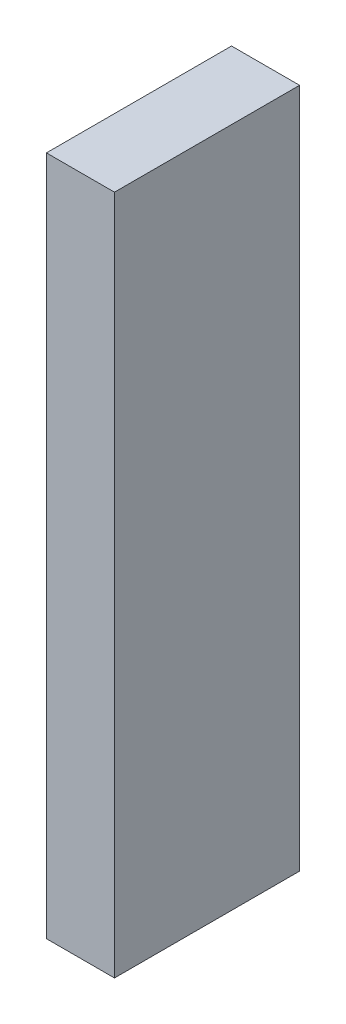
ISO-10303-21;
HEADER;
FILE_DESCRIPTION(('STEP AP214'),'2;1');
FILE_NAME('part.step','',(''),(''),'','','');
FILE_SCHEMA(('AUTOMOTIVE_DESIGN { 1 0 10303 214 1 1 1 1 }'));
ENDSEC;
DATA;
#1=APPLICATION_CONTEXT('core data for automotive mechanical design processes');
#2=APPLICATION_PROTOCOL_DEFINITION('international standard','automotive_design',2000,#1);
#3=PRODUCT_CONTEXT('',#1,'mechanical');
#4=PRODUCT('Part','Part','',(#3));
#5=PRODUCT_RELATED_PRODUCT_CATEGORY('part','',(#4));
#6=PRODUCT_DEFINITION_FORMATION('','',#4);
#7=PRODUCT_DEFINITION_CONTEXT('part definition',#1,'design');
#8=PRODUCT_DEFINITION('design','',#6,#7);
#9=PRODUCT_DEFINITION_SHAPE('','',#8);
#10=(LENGTH_UNIT() NAMED_UNIT(*) SI_UNIT(.MILLI.,.METRE.));
#11=(NAMED_UNIT(*) PLANE_ANGLE_UNIT() SI_UNIT($,.RADIAN.));
#12=(NAMED_UNIT(*) SI_UNIT($,.STERADIAN.) SOLID_ANGLE_UNIT());
#13=UNCERTAINTY_MEASURE_WITH_UNIT(LENGTH_MEASURE(1.E-05),#10,'distance_accuracy_value','');
#14=(GEOMETRIC_REPRESENTATION_CONTEXT(3) GLOBAL_UNCERTAINTY_ASSIGNED_CONTEXT((#13)) GLOBAL_UNIT_ASSIGNED_CONTEXT((#10,
#11,#12)) REPRESENTATION_CONTEXT('',''));
#15=CARTESIAN_POINT('',(0.,0.,0.));
#16=DIRECTION('',(0.,0.,1.));
#17=DIRECTION('',(1.,0.,0.));
#18=AXIS2_PLACEMENT_3D('',#15,#16,#17);
#19=CARTESIAN_POINT('',(3.175,-15.875,-4.318));
#20=DIRECTION('',(0.,0.,1.));
#21=DIRECTION('',(1.,0.,0.));
#22=AXIS2_PLACEMENT_3D('',#19,#20,#21);
#23=PLANE('',#22);
#24=DIRECTION('',(0.,1.,0.));
#25=VECTOR('',#24,1.);
#26=CARTESIAN_POINT('',(0.,-15.875,-4.318));
#27=LINE('',#26,#25);
#28=CARTESIAN_POINT('',(0.,-15.875,-4.318));
#29=VERTEX_POINT('',#28);
#30=CARTESIAN_POINT('',(0.,15.875,-4.318));
#31=VERTEX_POINT('',#30);
#32=EDGE_CURVE('E96',#29,#31,#27,.T.);
#33=ORIENTED_EDGE('',*,*,#32,.T.);
#34=DIRECTION('',(-1.,0.,0.));
#35=VECTOR('',#34,1.);
#36=CARTESIAN_POINT('',(3.175,15.875,-4.318));
#37=LINE('',#36,#35);
#38=CARTESIAN_POINT('',(3.175,15.875,-4.318));
#39=VERTEX_POINT('',#38);
#40=EDGE_CURVE('E11',#39,#31,#37,.T.);
#41=ORIENTED_EDGE('',*,*,#40,.F.);
#42=DIRECTION('',(0.,1.,0.));
#43=VECTOR('',#42,1.);
#44=CARTESIAN_POINT('',(3.175,-15.875,-4.318));
#45=LINE('',#44,#43);
#46=CARTESIAN_POINT('',(3.175,-15.875,-4.318));
#47=VERTEX_POINT('',#46);
#48=EDGE_CURVE('E84',#47,#39,#45,.T.);
#49=ORIENTED_EDGE('',*,*,#48,.F.);
#50=DIRECTION('',(-1.,0.,0.));
#51=VECTOR('',#50,1.);
#52=CARTESIAN_POINT('',(3.175,-15.875,-4.318));
#53=LINE('',#52,#51);
#54=EDGE_CURVE('E92',#47,#29,#53,.T.);
#55=ORIENTED_EDGE('',*,*,#54,.T.);
#56=EDGE_LOOP('',(#33,#41,#49,#55));
#57=FACE_BOUND('',#56,.T.);
#58=ADVANCED_FACE('F33',(#57),#23,.F.);
#59=CARTESIAN_POINT('',(3.175,15.875,4.318));
#60=DIRECTION('',(0.,-1.,0.));
#61=DIRECTION('',(0.,0.,-1.));
#62=AXIS2_PLACEMENT_3D('',#59,#60,#61);
#63=PLANE('',#62);
#64=DIRECTION('',(0.,0.,1.));
#65=VECTOR('',#64,1.);
#66=CARTESIAN_POINT('',(0.,15.875,4.318));
#67=LINE('',#66,#65);
#68=CARTESIAN_POINT('',(0.,15.875,4.318));
#69=VERTEX_POINT('',#68);
#70=EDGE_CURVE('E88',#31,#69,#67,.T.);
#71=ORIENTED_EDGE('',*,*,#70,.T.);
#72=DIRECTION('',(-1.,0.,0.));
#73=VECTOR('',#72,1.);
#74=CARTESIAN_POINT('',(3.175,15.875,4.318));
#75=LINE('',#74,#73);
#76=CARTESIAN_POINT('',(3.175,15.875,4.318));
#77=VERTEX_POINT('',#76);
#78=EDGE_CURVE('E41',#77,#69,#75,.T.);
#79=ORIENTED_EDGE('',*,*,#78,.F.);
#80=DIRECTION('',(0.,0.,1.));
#81=VECTOR('',#80,1.);
#82=CARTESIAN_POINT('',(3.175,15.875,4.318));
#83=LINE('',#82,#81);
#84=EDGE_CURVE('E79',#39,#77,#83,.T.);
#85=ORIENTED_EDGE('',*,*,#84,.F.);
#86=ORIENTED_EDGE('',*,*,#40,.T.);
#87=EDGE_LOOP('',(#71,#79,#85,#86));
#88=FACE_BOUND('',#87,.T.);
#89=ADVANCED_FACE('F87',(#88),#63,.F.);
#90=CARTESIAN_POINT('',(3.175,-15.875,4.318));
#91=DIRECTION('',(0.,0.,-1.));
#92=DIRECTION('',(-1.,0.,0.));
#93=AXIS2_PLACEMENT_3D('',#90,#91,#92);
#94=PLANE('',#93);
#95=DIRECTION('',(0.,-1.,0.));
#96=VECTOR('',#95,1.);
#97=CARTESIAN_POINT('',(0.,-15.875,4.318));
#98=LINE('',#97,#96);
#99=CARTESIAN_POINT('',(0.,-15.875,4.318));
#100=VERTEX_POINT('',#99);
#101=EDGE_CURVE('E66',#69,#100,#98,.T.);
#102=ORIENTED_EDGE('',*,*,#101,.T.);
#103=DIRECTION('',(-1.,0.,0.));
#104=VECTOR('',#103,1.);
#105=CARTESIAN_POINT('',(3.175,-15.875,4.318));
#106=LINE('',#105,#104);
#107=CARTESIAN_POINT('',(3.175,-15.875,4.318));
#108=VERTEX_POINT('',#107);
#109=EDGE_CURVE('E89',#108,#100,#106,.T.);
#110=ORIENTED_EDGE('',*,*,#109,.F.);
#111=DIRECTION('',(0.,-1.,0.));
#112=VECTOR('',#111,1.);
#113=CARTESIAN_POINT('',(3.175,-15.875,4.318));
#114=LINE('',#113,#112);
#115=EDGE_CURVE('E82',#77,#108,#114,.T.);
#116=ORIENTED_EDGE('',*,*,#115,.F.);
#117=ORIENTED_EDGE('',*,*,#78,.T.);
#118=EDGE_LOOP('',(#102,#110,#116,#117));
#119=FACE_BOUND('',#118,.T.);
#120=ADVANCED_FACE('F90',(#119),#94,.F.);
#121=CARTESIAN_POINT('',(3.175,-15.875,4.318));
#122=DIRECTION('',(0.,1.,0.));
#123=DIRECTION('',(0.,0.,1.));
#124=AXIS2_PLACEMENT_3D('',#121,#122,#123);
#125=PLANE('',#124);
#126=DIRECTION('',(0.,0.,-1.));
#127=VECTOR('',#126,1.);
#128=CARTESIAN_POINT('',(0.,-15.875,4.318));
#129=LINE('',#128,#127);
#130=EDGE_CURVE('E72',#100,#29,#129,.T.);
#131=ORIENTED_EDGE('',*,*,#130,.T.);
#132=ORIENTED_EDGE('',*,*,#54,.F.);
#133=DIRECTION('',(0.,0.,-1.));
#134=VECTOR('',#133,1.);
#135=CARTESIAN_POINT('',(3.175,-15.875,4.318));
#136=LINE('',#135,#134);
#137=EDGE_CURVE('E49',#108,#47,#136,.T.);
#138=ORIENTED_EDGE('',*,*,#137,.F.);
#139=ORIENTED_EDGE('',*,*,#109,.T.);
#140=EDGE_LOOP('',(#131,#132,#138,#139));
#141=FACE_BOUND('',#140,.T.);
#142=ADVANCED_FACE('F103',(#141),#125,.F.);
#143=CARTESIAN_POINT('',(3.175,15.875,-4.318));
#144=DIRECTION('',(-1.,0.,0.));
#145=DIRECTION('',(0.,0.,1.));
#146=AXIS2_PLACEMENT_3D('',#143,#144,#145);
#147=PLANE('',#146);
#148=ORIENTED_EDGE('',*,*,#48,.T.);
#149=ORIENTED_EDGE('',*,*,#84,.T.);
#150=ORIENTED_EDGE('',*,*,#115,.T.);
#151=ORIENTED_EDGE('',*,*,#137,.T.);
#152=EDGE_LOOP('',(#148,#149,#150,#151));
#153=FACE_BOUND('',#152,.T.);
#154=ADVANCED_FACE('F80',(#153),#147,.F.);
#155=CARTESIAN_POINT('',(0.,15.875,-4.318));
#156=DIRECTION('',(-1.,0.,0.));
#157=DIRECTION('',(0.,0.,1.));
#158=AXIS2_PLACEMENT_3D('',#155,#156,#157);
#159=PLANE('',#158);
#160=ORIENTED_EDGE('',*,*,#32,.F.);
#161=ORIENTED_EDGE('',*,*,#130,.F.);
#162=ORIENTED_EDGE('',*,*,#101,.F.);
#163=ORIENTED_EDGE('',*,*,#70,.F.);
#164=EDGE_LOOP('',(#160,#161,#162,#163));
#165=FACE_BOUND('',#164,.T.);
#166=ADVANCED_FACE('F106',(#165),#159,.T.);
#167=CLOSED_SHELL('',(#58,#89,#120,#142,#154,#166));
#168=MANIFOLD_SOLID_BREP('B2',#167);
#169=ADVANCED_BREP_SHAPE_REPRESENTATION('',(#18,#168),#14);
#170=SHAPE_DEFINITION_REPRESENTATION(#9,#169);
ENDSEC;
END-ISO-10303-21;
